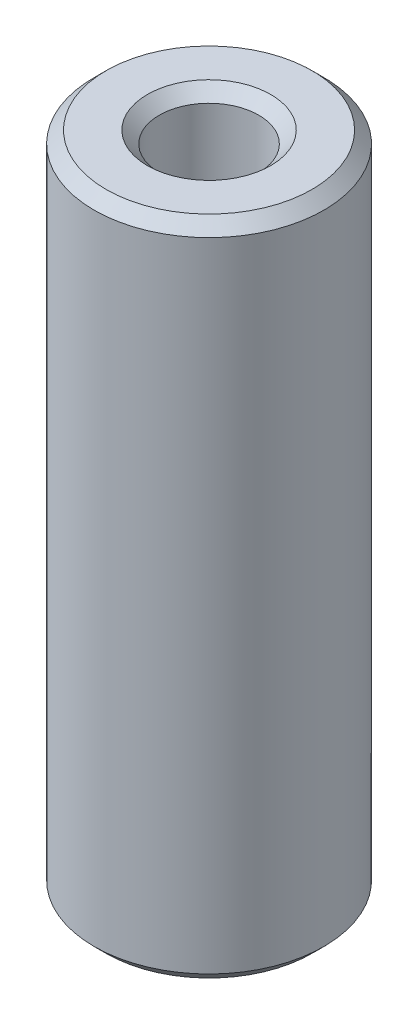
ISO-10303-21;
HEADER;
FILE_DESCRIPTION(('STEP AP214'),'2;1');
FILE_NAME('part.step','',(''),(''),'','','');
FILE_SCHEMA(('AUTOMOTIVE_DESIGN { 1 0 10303 214 1 1 1 1 }'));
ENDSEC;
DATA;
#1=APPLICATION_CONTEXT('core data for automotive mechanical design processes');
#2=APPLICATION_PROTOCOL_DEFINITION('international standard','automotive_design',2000,#1);
#3=PRODUCT_CONTEXT('',#1,'mechanical');
#4=PRODUCT('Part','Part','',(#3));
#5=PRODUCT_RELATED_PRODUCT_CATEGORY('part','',(#4));
#6=PRODUCT_DEFINITION_FORMATION('','',#4);
#7=PRODUCT_DEFINITION_CONTEXT('part definition',#1,'design');
#8=PRODUCT_DEFINITION('design','',#6,#7);
#9=PRODUCT_DEFINITION_SHAPE('','',#8);
#10=(LENGTH_UNIT() NAMED_UNIT(*) SI_UNIT(.MILLI.,.METRE.));
#11=(NAMED_UNIT(*) PLANE_ANGLE_UNIT() SI_UNIT($,.RADIAN.));
#12=(NAMED_UNIT(*) SI_UNIT($,.STERADIAN.) SOLID_ANGLE_UNIT());
#13=UNCERTAINTY_MEASURE_WITH_UNIT(LENGTH_MEASURE(1.E-05),#10,'distance_accuracy_value','');
#14=(GEOMETRIC_REPRESENTATION_CONTEXT(3) GLOBAL_UNCERTAINTY_ASSIGNED_CONTEXT((#13)) GLOBAL_UNIT_ASSIGNED_CONTEXT((#10,
#11,#12)) REPRESENTATION_CONTEXT('',''));
#15=CARTESIAN_POINT('',(0.,0.,0.));
#16=DIRECTION('',(0.,0.,1.));
#17=DIRECTION('',(1.,0.,0.));
#18=AXIS2_PLACEMENT_3D('',#15,#16,#17);
#19=CARTESIAN_POINT('',(0.,129.570767044648,0.));
#20=DIRECTION('',(0.,-1.,0.));
#21=DIRECTION('',(0.,0.,-1.));
#22=AXIS2_PLACEMENT_3D('',#19,#20,#21);
#23=CYLINDRICAL_SURFACE('',#22,22.5);
#24=CARTESIAN_POINT('',(0.,2.33972604624666,0.));
#25=DIRECTION('',(0.,1.,0.));
#26=DIRECTION('',(0.,0.,1.));
#27=AXIS2_PLACEMENT_3D('',#24,#25,#26);
#28=CIRCLE('',#27,22.5);
#29=CARTESIAN_POINT('',(0.,2.33972604624666,22.5));
#30=VERTEX_POINT('',#29);
#31=EDGE_CURVE('E10',#30,#30,#28,.T.);
#32=ORIENTED_EDGE('',*,*,#31,.T.);
#33=EDGE_LOOP('',(#32));
#34=FACE_BOUND('',#33,.T.);
#35=CARTESIAN_POINT('',(0.,127.231040998401,0.));
#36=DIRECTION('',(0.,1.,0.));
#37=DIRECTION('',(0.,0.,1.));
#38=AXIS2_PLACEMENT_3D('',#35,#36,#37);
#39=CIRCLE('',#38,22.5);
#40=CARTESIAN_POINT('',(0.,127.231040998401,22.5));
#41=VERTEX_POINT('',#40);
#42=EDGE_CURVE('E50',#41,#41,#39,.F.);
#43=ORIENTED_EDGE('',*,*,#42,.T.);
#44=EDGE_LOOP('',(#43));
#45=FACE_BOUND('',#44,.T.);
#46=ADVANCED_FACE('F39',(#34,#45),#23,.T.);
#47=CARTESIAN_POINT('',(0.,129.570767044648,0.));
#48=DIRECTION('',(0.,1.,0.));
#49=DIRECTION('',(0.,0.,1.));
#50=AXIS2_PLACEMENT_3D('',#47,#48,#49);
#51=PLANE('',#50);
#52=CARTESIAN_POINT('',(0.,129.570767044648,0.));
#53=DIRECTION('',(0.,1.,0.));
#54=DIRECTION('',(0.,0.,1.));
#55=AXIS2_PLACEMENT_3D('',#52,#53,#54);
#56=CIRCLE('',#55,12.0794568807281);
#57=CARTESIAN_POINT('',(0.,129.570767044648,12.0794568807281));
#58=VERTEX_POINT('',#57);
#59=EDGE_CURVE('E58',#58,#58,#56,.F.);
#60=ORIENTED_EDGE('',*,*,#59,.T.);
#61=EDGE_LOOP('',(#60));
#62=FACE_BOUND('',#61,.T.);
#63=CARTESIAN_POINT('',(0.,129.570767044648,0.));
#64=DIRECTION('',(0.,1.,0.));
#65=DIRECTION('',(0.,0.,1.));
#66=AXIS2_PLACEMENT_3D('',#63,#64,#65);
#67=CIRCLE('',#66,20.1602739537533);
#68=CARTESIAN_POINT('',(0.,129.570767044648,20.1602739537533));
#69=VERTEX_POINT('',#68);
#70=EDGE_CURVE('E61',#69,#69,#67,.T.);
#71=ORIENTED_EDGE('',*,*,#70,.T.);
#72=EDGE_LOOP('',(#71));
#73=FACE_BOUND('',#72,.T.);
#74=ADVANCED_FACE('F88',(#62,#73),#51,.T.);
#75=CARTESIAN_POINT('',(0.,0.,0.));
#76=DIRECTION('',(0.,1.,0.));
#77=DIRECTION('',(0.,0.,1.));
#78=AXIS2_PLACEMENT_3D('',#75,#76,#77);
#79=PLANE('',#78);
#80=CARTESIAN_POINT('',(0.,0.,0.));
#81=DIRECTION('',(0.,1.,0.));
#82=DIRECTION('',(0.,0.,1.));
#83=AXIS2_PLACEMENT_3D('',#80,#81,#82);
#84=CIRCLE('',#83,12.0794568807281);
#85=CARTESIAN_POINT('',(0.,0.,12.0794568807281));
#86=VERTEX_POINT('',#85);
#87=EDGE_CURVE('E51',#86,#86,#84,.T.);
#88=ORIENTED_EDGE('',*,*,#87,.T.);
#89=EDGE_LOOP('',(#88));
#90=FACE_BOUND('',#89,.T.);
#91=CARTESIAN_POINT('',(0.,0.,0.));
#92=DIRECTION('',(0.,1.,0.));
#93=DIRECTION('',(0.,0.,1.));
#94=AXIS2_PLACEMENT_3D('',#91,#92,#93);
#95=CIRCLE('',#94,20.1602739537533);
#96=CARTESIAN_POINT('',(0.,0.,20.1602739537533));
#97=VERTEX_POINT('',#96);
#98=EDGE_CURVE('E54',#97,#97,#95,.F.);
#99=ORIENTED_EDGE('',*,*,#98,.T.);
#100=EDGE_LOOP('',(#99));
#101=FACE_BOUND('',#100,.T.);
#102=ADVANCED_FACE('F83',(#90,#101),#79,.F.);
#103=CARTESIAN_POINT('',(0.,129.570767044648,0.));
#104=DIRECTION('',(0.,-1.,0.));
#105=DIRECTION('',(0.,0.,-1.));
#106=AXIS2_PLACEMENT_3D('',#103,#104,#105);
#107=CYLINDRICAL_SURFACE('',#106,9.73973083448145);
#108=CARTESIAN_POINT('',(0.,127.231040998401,0.));
#109=DIRECTION('',(0.,1.,0.));
#110=DIRECTION('',(0.,0.,1.));
#111=AXIS2_PLACEMENT_3D('',#108,#109,#110);
#112=CIRCLE('',#111,9.73973083448145);
#113=CARTESIAN_POINT('',(0.,127.231040998401,9.73973083448145));
#114=VERTEX_POINT('',#113);
#115=EDGE_CURVE('E67',#114,#114,#112,.T.);
#116=ORIENTED_EDGE('',*,*,#115,.T.);
#117=EDGE_LOOP('',(#116));
#118=FACE_BOUND('',#117,.T.);
#119=CARTESIAN_POINT('',(0.,2.33972604624663,0.));
#120=DIRECTION('',(0.,1.,0.));
#121=DIRECTION('',(0.,0.,1.));
#122=AXIS2_PLACEMENT_3D('',#119,#120,#121);
#123=CIRCLE('',#122,9.73973083448145);
#124=CARTESIAN_POINT('',(0.,2.33972604624663,9.73973083448145));
#125=VERTEX_POINT('',#124);
#126=EDGE_CURVE('E69',#125,#125,#123,.F.);
#127=ORIENTED_EDGE('',*,*,#126,.T.);
#128=EDGE_LOOP('',(#127));
#129=FACE_BOUND('',#128,.T.);
#130=ADVANCED_FACE('F71',(#118,#129),#107,.F.);
#131=CARTESIAN_POINT('',(0.,127.231040998401,0.));
#132=DIRECTION('',(0.,1.,0.));
#133=DIRECTION('',(0.,0.,1.));
#134=AXIS2_PLACEMENT_3D('',#131,#132,#133);
#135=CONICAL_SURFACE('',#134,9.73973083448145,0.785398163397449);
#136=ORIENTED_EDGE('',*,*,#59,.F.);
#137=EDGE_LOOP('',(#136));
#138=FACE_BOUND('',#137,.T.);
#139=ORIENTED_EDGE('',*,*,#115,.F.);
#140=EDGE_LOOP('',(#139));
#141=FACE_BOUND('',#140,.T.);
#142=ADVANCED_FACE('F77',(#138,#141),#135,.F.);
#143=CARTESIAN_POINT('',(0.,0.,0.));
#144=DIRECTION('',(0.,-1.,0.));
#145=DIRECTION('',(0.,0.,-1.));
#146=AXIS2_PLACEMENT_3D('',#143,#144,#145);
#147=CONICAL_SURFACE('',#146,12.0794568807281,0.785398163397443);
#148=ORIENTED_EDGE('',*,*,#126,.F.);
#149=EDGE_LOOP('',(#148));
#150=FACE_BOUND('',#149,.T.);
#151=ORIENTED_EDGE('',*,*,#87,.F.);
#152=EDGE_LOOP('',(#151));
#153=FACE_BOUND('',#152,.T.);
#154=ADVANCED_FACE('F73',(#150,#153),#147,.F.);
#155=CARTESIAN_POINT('',(0.,2.33972604624666,0.));
#156=DIRECTION('',(0.,1.,0.));
#157=DIRECTION('',(0.,0.,1.));
#158=AXIS2_PLACEMENT_3D('',#155,#156,#157);
#159=CONICAL_SURFACE('',#158,22.5,0.785398163397454);
#160=ORIENTED_EDGE('',*,*,#98,.F.);
#161=EDGE_LOOP('',(#160));
#162=FACE_BOUND('',#161,.T.);
#163=ORIENTED_EDGE('',*,*,#31,.F.);
#164=EDGE_LOOP('',(#163));
#165=FACE_BOUND('',#164,.T.);
#166=ADVANCED_FACE('F76',(#162,#165),#159,.T.);
#167=CARTESIAN_POINT('',(0.,129.570767044648,0.));
#168=DIRECTION('',(0.,-1.,0.));
#169=DIRECTION('',(0.,0.,-1.));
#170=AXIS2_PLACEMENT_3D('',#167,#168,#169);
#171=CONICAL_SURFACE('',#170,20.1602739537533,0.785398163397445);
#172=ORIENTED_EDGE('',*,*,#42,.F.);
#173=EDGE_LOOP('',(#172));
#174=FACE_BOUND('',#173,.T.);
#175=ORIENTED_EDGE('',*,*,#70,.F.);
#176=EDGE_LOOP('',(#175));
#177=FACE_BOUND('',#176,.T.);
#178=ADVANCED_FACE('F45',(#174,#177),#171,.T.);
#179=CLOSED_SHELL('',(#46,#74,#102,#130,#142,#154,#166,#178));
#180=MANIFOLD_SOLID_BREP('B2',#179);
#181=ADVANCED_BREP_SHAPE_REPRESENTATION('',(#18,#180),#14);
#182=SHAPE_DEFINITION_REPRESENTATION(#9,#181);
ENDSEC;
END-ISO-10303-21;
